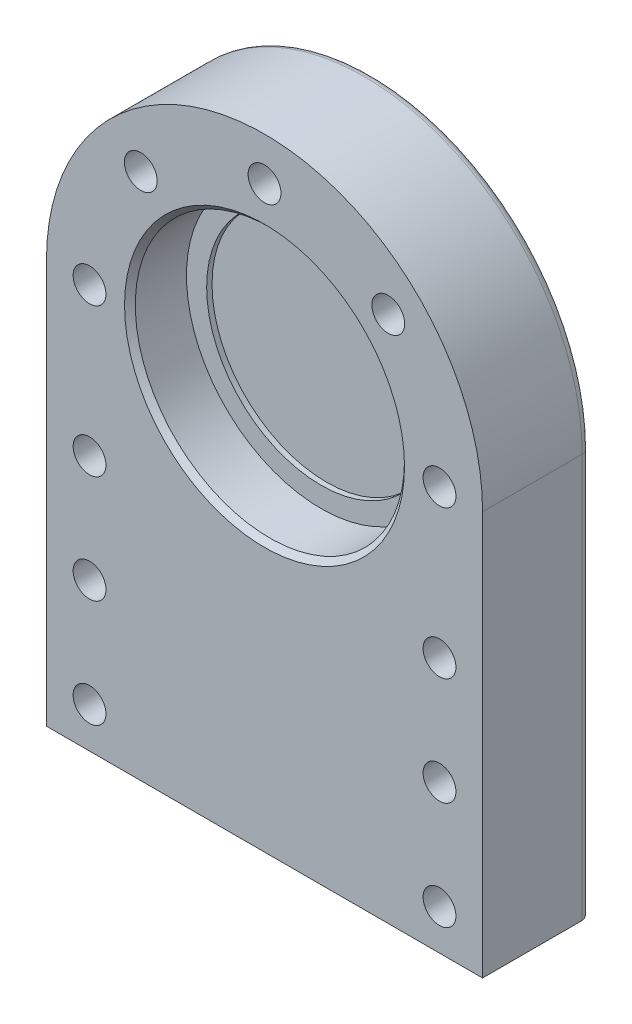
ISO-10303-21;
HEADER;
FILE_DESCRIPTION(('STEP AP214'),'2;1');
FILE_NAME('part.step','',(''),(''),'','','');
FILE_SCHEMA(('AUTOMOTIVE_DESIGN { 1 0 10303 214 1 1 1 1 }'));
ENDSEC;
DATA;
#1=APPLICATION_CONTEXT('core data for automotive mechanical design processes');
#2=APPLICATION_PROTOCOL_DEFINITION('international standard','automotive_design',2000,#1);
#3=PRODUCT_CONTEXT('',#1,'mechanical');
#4=PRODUCT('Part','Part','',(#3));
#5=PRODUCT_RELATED_PRODUCT_CATEGORY('part','',(#4));
#6=PRODUCT_DEFINITION_FORMATION('','',#4);
#7=PRODUCT_DEFINITION_CONTEXT('part definition',#1,'design');
#8=PRODUCT_DEFINITION('design','',#6,#7);
#9=PRODUCT_DEFINITION_SHAPE('','',#8);
#10=(LENGTH_UNIT() NAMED_UNIT(*) SI_UNIT(.MILLI.,.METRE.));
#11=(NAMED_UNIT(*) PLANE_ANGLE_UNIT() SI_UNIT($,.RADIAN.));
#12=(NAMED_UNIT(*) SI_UNIT($,.STERADIAN.) SOLID_ANGLE_UNIT());
#13=UNCERTAINTY_MEASURE_WITH_UNIT(LENGTH_MEASURE(1.E-05),#10,'distance_accuracy_value','');
#14=(GEOMETRIC_REPRESENTATION_CONTEXT(3) GLOBAL_UNCERTAINTY_ASSIGNED_CONTEXT((#13)) GLOBAL_UNIT_ASSIGNED_CONTEXT((#10,
#11,#12)) REPRESENTATION_CONTEXT('',''));
#15=CARTESIAN_POINT('',(0.,0.,0.));
#16=DIRECTION('',(0.,0.,1.));
#17=DIRECTION('',(1.,0.,0.));
#18=AXIS2_PLACEMENT_3D('',#15,#16,#17);
#19=CARTESIAN_POINT('',(0.,0.,40.));
#20=DIRECTION('',(0.,0.,-1.));
#21=DIRECTION('',(-1.,0.,0.));
#22=AXIS2_PLACEMENT_3D('',#19,#20,#21);
#23=CYLINDRICAL_SURFACE('',#22,81.);
#24=DIRECTION('',(0.,0.,-1.));
#25=VECTOR('',#24,1.);
#26=CARTESIAN_POINT('',(81.,0.,40.));
#27=LINE('',#26,#25);
#28=CARTESIAN_POINT('',(81.,0.,40.));
#29=VERTEX_POINT('',#28);
#30=CARTESIAN_POINT('',(81.,0.,3.));
#31=VERTEX_POINT('',#30);
#32=EDGE_CURVE('E278',#29,#31,#27,.T.);
#33=ORIENTED_EDGE('',*,*,#32,.T.);
#34=CARTESIAN_POINT('',(0.,0.,3.));
#35=DIRECTION('',(0.,0.,1.));
#36=DIRECTION('',(1.,0.,0.));
#37=AXIS2_PLACEMENT_3D('',#34,#35,#36);
#38=CIRCLE('',#37,81.);
#39=CARTESIAN_POINT('',(-81.,0.,3.));
#40=VERTEX_POINT('',#39);
#41=EDGE_CURVE('E120',#31,#40,#38,.T.);
#42=ORIENTED_EDGE('',*,*,#41,.T.);
#43=DIRECTION('',(0.,0.,-1.));
#44=VECTOR('',#43,1.);
#45=CARTESIAN_POINT('',(-81.,0.,40.));
#46=LINE('',#45,#44);
#47=CARTESIAN_POINT('',(-81.,0.,40.));
#48=VERTEX_POINT('',#47);
#49=EDGE_CURVE('E102',#48,#40,#46,.T.);
#50=ORIENTED_EDGE('',*,*,#49,.F.);
#51=CARTESIAN_POINT('',(0.,0.,40.));
#52=DIRECTION('',(0.,0.,1.));
#53=DIRECTION('',(1.,0.,0.));
#54=AXIS2_PLACEMENT_3D('',#51,#52,#53);
#55=CIRCLE('',#54,81.);
#56=EDGE_CURVE('E109',#29,#48,#55,.T.);
#57=ORIENTED_EDGE('',*,*,#56,.F.);
#58=EDGE_LOOP('',(#33,#42,#50,#57));
#59=FACE_BOUND('',#58,.T.);
#60=ADVANCED_FACE('F41',(#59),#23,.T.);
#61=CARTESIAN_POINT('',(-81.,0.,40.));
#62=DIRECTION('',(1.,0.,0.));
#63=DIRECTION('',(0.,0.,-1.));
#64=AXIS2_PLACEMENT_3D('',#61,#62,#63);
#65=PLANE('',#64);
#66=ORIENTED_EDGE('',*,*,#49,.T.);
#67=DIRECTION('',(0.,-1.,0.));
#68=VECTOR('',#67,1.);
#69=CARTESIAN_POINT('',(-81.,0.,3.));
#70=LINE('',#69,#68);
#71=CARTESIAN_POINT('',(-81.,-150.,3.));
#72=VERTEX_POINT('',#71);
#73=EDGE_CURVE('E136',#40,#72,#70,.T.);
#74=ORIENTED_EDGE('',*,*,#73,.T.);
#75=DIRECTION('',(0.,0.,-1.));
#76=VECTOR('',#75,1.);
#77=CARTESIAN_POINT('',(-81.,-150.,40.));
#78=LINE('',#77,#76);
#79=CARTESIAN_POINT('',(-81.,-150.,40.));
#80=VERTEX_POINT('',#79);
#81=EDGE_CURVE('E104',#80,#72,#78,.T.);
#82=ORIENTED_EDGE('',*,*,#81,.F.);
#83=DIRECTION('',(0.,-1.,0.));
#84=VECTOR('',#83,1.);
#85=CARTESIAN_POINT('',(-81.,0.,40.));
#86=LINE('',#85,#84);
#87=EDGE_CURVE('E97',#48,#80,#86,.T.);
#88=ORIENTED_EDGE('',*,*,#87,.F.);
#89=EDGE_LOOP('',(#66,#74,#82,#88));
#90=FACE_BOUND('',#89,.T.);
#91=ADVANCED_FACE('F99',(#90),#65,.F.);
#92=CARTESIAN_POINT('',(-81.,-150.,40.));
#93=DIRECTION('',(0.,1.,0.));
#94=DIRECTION('',(0.,0.,1.));
#95=AXIS2_PLACEMENT_3D('',#92,#93,#94);
#96=PLANE('',#95);
#97=ORIENTED_EDGE('',*,*,#81,.T.);
#98=DIRECTION('',(1.,0.,0.));
#99=VECTOR('',#98,1.);
#100=CARTESIAN_POINT('',(-81.,-150.,3.));
#101=LINE('',#100,#99);
#102=CARTESIAN_POINT('',(81.,-150.,3.));
#103=VERTEX_POINT('',#102);
#104=EDGE_CURVE('E11',#72,#103,#101,.T.);
#105=ORIENTED_EDGE('',*,*,#104,.T.);
#106=DIRECTION('',(0.,0.,-1.));
#107=VECTOR('',#106,1.);
#108=CARTESIAN_POINT('',(81.,-150.,40.));
#109=LINE('',#108,#107);
#110=CARTESIAN_POINT('',(81.,-150.,40.));
#111=VERTEX_POINT('',#110);
#112=EDGE_CURVE('E129',#111,#103,#109,.T.);
#113=ORIENTED_EDGE('',*,*,#112,.F.);
#114=DIRECTION('',(1.,0.,0.));
#115=VECTOR('',#114,1.);
#116=CARTESIAN_POINT('',(-81.,-150.,40.));
#117=LINE('',#116,#115);
#118=EDGE_CURVE('E108',#80,#111,#117,.T.);
#119=ORIENTED_EDGE('',*,*,#118,.F.);
#120=EDGE_LOOP('',(#97,#105,#113,#119));
#121=FACE_BOUND('',#120,.T.);
#122=ADVANCED_FACE('F290',(#121),#96,.F.);
#123=CARTESIAN_POINT('',(81.,-150.,40.));
#124=DIRECTION('',(-1.,0.,0.));
#125=DIRECTION('',(0.,0.,1.));
#126=AXIS2_PLACEMENT_3D('',#123,#124,#125);
#127=PLANE('',#126);
#128=ORIENTED_EDGE('',*,*,#112,.T.);
#129=DIRECTION('',(0.,1.,0.));
#130=VECTOR('',#129,1.);
#131=CARTESIAN_POINT('',(81.,-150.,3.));
#132=LINE('',#131,#130);
#133=EDGE_CURVE('E51',#103,#31,#132,.T.);
#134=ORIENTED_EDGE('',*,*,#133,.T.);
#135=ORIENTED_EDGE('',*,*,#32,.F.);
#136=DIRECTION('',(0.,1.,0.));
#137=VECTOR('',#136,1.);
#138=CARTESIAN_POINT('',(81.,-150.,40.));
#139=LINE('',#138,#137);
#140=EDGE_CURVE('E114',#111,#29,#139,.T.);
#141=ORIENTED_EDGE('',*,*,#140,.F.);
#142=EDGE_LOOP('',(#128,#134,#135,#141));
#143=FACE_BOUND('',#142,.T.);
#144=ADVANCED_FACE('F281',(#143),#127,.F.);
#145=CARTESIAN_POINT('',(0.,0.,40.));
#146=DIRECTION('',(0.,0.,1.));
#147=DIRECTION('',(1.,0.,0.));
#148=AXIS2_PLACEMENT_3D('',#145,#146,#147);
#149=PLANE('',#148);
#150=CARTESIAN_POINT('',(0.,0.,40.));
#151=DIRECTION('',(0.,0.,1.));
#152=DIRECTION('',(1.,0.,0.));
#153=AXIS2_PLACEMENT_3D('',#150,#151,#152);
#154=CIRCLE('',#153,52.0000000000001);
#155=CARTESIAN_POINT('',(52.0000000000001,0.,40.));
#156=VERTEX_POINT('',#155);
#157=EDGE_CURVE('E127',#156,#156,#154,.F.);
#158=ORIENTED_EDGE('',*,*,#157,.T.);
#159=EDGE_LOOP('',(#158));
#160=FACE_BOUND('',#159,.T.);
#161=CARTESIAN_POINT('',(65.,-135.,40.));
#162=DIRECTION('',(0.,0.,-1.));
#163=DIRECTION('',(-1.,0.,0.));
#164=AXIS2_PLACEMENT_3D('',#161,#162,#163);
#165=CIRCLE('',#164,6.1);
#166=CARTESIAN_POINT('',(58.9,-135.,40.));
#167=VERTEX_POINT('',#166);
#168=EDGE_CURVE('E193',#167,#167,#165,.T.);
#169=ORIENTED_EDGE('',*,*,#168,.T.);
#170=EDGE_LOOP('',(#169));
#171=FACE_BOUND('',#170,.T.);
#172=CARTESIAN_POINT('',(65.,-95.,40.));
#173=DIRECTION('',(0.,0.,-1.));
#174=DIRECTION('',(-1.,0.,0.));
#175=AXIS2_PLACEMENT_3D('',#172,#173,#174);
#176=CIRCLE('',#175,6.1);
#177=CARTESIAN_POINT('',(58.9,-95.,40.));
#178=VERTEX_POINT('',#177);
#179=EDGE_CURVE('E201',#178,#178,#176,.T.);
#180=ORIENTED_EDGE('',*,*,#179,.T.);
#181=EDGE_LOOP('',(#180));
#182=FACE_BOUND('',#181,.T.);
#183=CARTESIAN_POINT('',(65.,-55.,40.));
#184=DIRECTION('',(0.,0.,-1.));
#185=DIRECTION('',(-1.,0.,0.));
#186=AXIS2_PLACEMENT_3D('',#183,#184,#185);
#187=CIRCLE('',#186,6.1);
#188=CARTESIAN_POINT('',(58.9,-55.,40.));
#189=VERTEX_POINT('',#188);
#190=EDGE_CURVE('E187',#189,#189,#187,.T.);
#191=ORIENTED_EDGE('',*,*,#190,.T.);
#192=EDGE_LOOP('',(#191));
#193=FACE_BOUND('',#192,.T.);
#194=CARTESIAN_POINT('',(-65.,-135.,40.));
#195=DIRECTION('',(0.,0.,1.));
#196=DIRECTION('',(1.,0.,0.));
#197=AXIS2_PLACEMENT_3D('',#194,#195,#196);
#198=CIRCLE('',#197,6.1);
#199=CARTESIAN_POINT('',(-58.9,-135.,40.));
#200=VERTEX_POINT('',#199);
#201=EDGE_CURVE('E217',#200,#200,#198,.T.);
#202=ORIENTED_EDGE('',*,*,#201,.F.);
#203=EDGE_LOOP('',(#202));
#204=FACE_BOUND('',#203,.T.);
#205=CARTESIAN_POINT('',(-65.,-95.,40.));
#206=DIRECTION('',(0.,0.,1.));
#207=DIRECTION('',(1.,0.,0.));
#208=AXIS2_PLACEMENT_3D('',#205,#206,#207);
#209=CIRCLE('',#208,6.1);
#210=CARTESIAN_POINT('',(-58.9,-95.,40.));
#211=VERTEX_POINT('',#210);
#212=EDGE_CURVE('E225',#211,#211,#209,.T.);
#213=ORIENTED_EDGE('',*,*,#212,.F.);
#214=EDGE_LOOP('',(#213));
#215=FACE_BOUND('',#214,.T.);
#216=CARTESIAN_POINT('',(-65.,-55.,40.));
#217=DIRECTION('',(0.,0.,1.));
#218=DIRECTION('',(1.,0.,0.));
#219=AXIS2_PLACEMENT_3D('',#216,#217,#218);
#220=CIRCLE('',#219,6.1);
#221=CARTESIAN_POINT('',(-58.9,-55.,40.));
#222=VERTEX_POINT('',#221);
#223=EDGE_CURVE('E192',#222,#222,#220,.T.);
#224=ORIENTED_EDGE('',*,*,#223,.F.);
#225=EDGE_LOOP('',(#224));
#226=FACE_BOUND('',#225,.T.);
#227=CARTESIAN_POINT('',(-45.9619407771255,45.9619407771257,40.));
#228=DIRECTION('',(0.,0.,1.));
#229=DIRECTION('',(0.707106781186546,-0.707106781186549,0.));
#230=AXIS2_PLACEMENT_3D('',#227,#228,#229);
#231=CIRCLE('',#230,6.1);
#232=CARTESIAN_POINT('',(-41.6485894118876,41.6485894118877,40.));
#233=VERTEX_POINT('',#232);
#234=EDGE_CURVE('E241',#233,#233,#231,.T.);
#235=ORIENTED_EDGE('',*,*,#234,.F.);
#236=EDGE_LOOP('',(#235));
#237=FACE_BOUND('',#236,.T.);
#238=CARTESIAN_POINT('',(2.26946287024804E-13,65.,40.));
#239=DIRECTION('',(0.,0.,1.));
#240=DIRECTION('',(0.,-1.,0.));
#241=AXIS2_PLACEMENT_3D('',#238,#239,#240);
#242=CIRCLE('',#241,6.1);
#243=CARTESIAN_POINT('',(2.05648250857861E-13,58.9,40.));
#244=VERTEX_POINT('',#243);
#245=EDGE_CURVE('E249',#244,#244,#242,.T.);
#246=ORIENTED_EDGE('',*,*,#245,.F.);
#247=EDGE_LOOP('',(#246));
#248=FACE_BOUND('',#247,.T.);
#249=CARTESIAN_POINT('',(45.9619407771258,45.9619407771253,40.));
#250=DIRECTION('',(0.,0.,1.));
#251=DIRECTION('',(-0.707106781186551,-0.707106781186544,0.));
#252=AXIS2_PLACEMENT_3D('',#249,#250,#251);
#253=CIRCLE('',#252,6.1);
#254=CARTESIAN_POINT('',(41.6485894118879,41.6485894118874,40.));
#255=VERTEX_POINT('',#254);
#256=EDGE_CURVE('E257',#255,#255,#253,.T.);
#257=ORIENTED_EDGE('',*,*,#256,.F.);
#258=EDGE_LOOP('',(#257));
#259=FACE_BOUND('',#258,.T.);
#260=CARTESIAN_POINT('',(65.,0.,40.));
#261=DIRECTION('',(0.,0.,1.));
#262=DIRECTION('',(-1.,0.,0.));
#263=AXIS2_PLACEMENT_3D('',#260,#261,#262);
#264=CIRCLE('',#263,6.1);
#265=CARTESIAN_POINT('',(58.9,0.,40.));
#266=VERTEX_POINT('',#265);
#267=EDGE_CURVE('E216',#266,#266,#264,.T.);
#268=ORIENTED_EDGE('',*,*,#267,.F.);
#269=EDGE_LOOP('',(#268));
#270=FACE_BOUND('',#269,.T.);
#271=CARTESIAN_POINT('',(-65.,0.,40.));
#272=DIRECTION('',(0.,0.,1.));
#273=DIRECTION('',(1.,0.,0.));
#274=AXIS2_PLACEMENT_3D('',#271,#272,#273);
#275=CIRCLE('',#274,6.1);
#276=CARTESIAN_POINT('',(-58.9,0.,40.));
#277=VERTEX_POINT('',#276);
#278=EDGE_CURVE('E240',#277,#277,#275,.T.);
#279=ORIENTED_EDGE('',*,*,#278,.F.);
#280=EDGE_LOOP('',(#279));
#281=FACE_BOUND('',#280,.T.);
#282=ORIENTED_EDGE('',*,*,#56,.T.);
#283=ORIENTED_EDGE('',*,*,#87,.T.);
#284=ORIENTED_EDGE('',*,*,#118,.T.);
#285=ORIENTED_EDGE('',*,*,#140,.T.);
#286=EDGE_LOOP('',(#282,#283,#284,#285));
#287=FACE_BOUND('',#286,.T.);
#288=ADVANCED_FACE('F112',(#160,#171,#182,#193,#204,#215,#226,#237,#248,#259,#270,#281,#287),
#149,.T.);
#289=CARTESIAN_POINT('',(0.,0.,0.));
#290=DIRECTION('',(0.,0.,1.));
#291=DIRECTION('',(1.,0.,0.));
#292=AXIS2_PLACEMENT_3D('',#289,#290,#291);
#293=PLANE('',#292);
#294=DIRECTION('',(1.,0.,0.));
#295=VECTOR('',#294,1.);
#296=CARTESIAN_POINT('',(0.,-147.,0.));
#297=LINE('',#296,#295);
#298=CARTESIAN_POINT('',(78.,-147.,0.));
#299=VERTEX_POINT('',#298);
#300=CARTESIAN_POINT('',(-78.,-147.,0.));
#301=VERTEX_POINT('',#300);
#302=EDGE_CURVE('E139',#299,#301,#297,.F.);
#303=ORIENTED_EDGE('',*,*,#302,.T.);
#304=DIRECTION('',(0.,-1.,0.));
#305=VECTOR('',#304,1.);
#306=CARTESIAN_POINT('',(-78.,0.,0.));
#307=LINE('',#306,#305);
#308=CARTESIAN_POINT('',(-78.,0.,0.));
#309=VERTEX_POINT('',#308);
#310=EDGE_CURVE('E148',#301,#309,#307,.F.);
#311=ORIENTED_EDGE('',*,*,#310,.T.);
#312=CARTESIAN_POINT('',(0.,0.,0.));
#313=DIRECTION('',(0.,0.,1.));
#314=DIRECTION('',(1.,0.,0.));
#315=AXIS2_PLACEMENT_3D('',#312,#313,#314);
#316=CIRCLE('',#315,78.);
#317=CARTESIAN_POINT('',(78.,0.,0.));
#318=VERTEX_POINT('',#317);
#319=EDGE_CURVE('E145',#309,#318,#316,.F.);
#320=ORIENTED_EDGE('',*,*,#319,.T.);
#321=DIRECTION('',(0.,1.,0.));
#322=VECTOR('',#321,1.);
#323=CARTESIAN_POINT('',(78.,0.,0.));
#324=LINE('',#323,#322);
#325=EDGE_CURVE('E142',#318,#299,#324,.F.);
#326=ORIENTED_EDGE('',*,*,#325,.T.);
#327=EDGE_LOOP('',(#303,#311,#320,#326));
#328=FACE_BOUND('',#327,.T.);
#329=CARTESIAN_POINT('',(65.,-135.,0.));
#330=DIRECTION('',(0.,0.,-1.));
#331=DIRECTION('',(-1.,0.,0.));
#332=AXIS2_PLACEMENT_3D('',#329,#330,#331);
#333=CIRCLE('',#332,6.1);
#334=CARTESIAN_POINT('',(58.9,-135.,0.));
#335=VERTEX_POINT('',#334);
#336=EDGE_CURVE('E188',#335,#335,#333,.T.);
#337=ORIENTED_EDGE('',*,*,#336,.F.);
#338=EDGE_LOOP('',(#337));
#339=FACE_BOUND('',#338,.T.);
#340=CARTESIAN_POINT('',(65.,-95.,0.));
#341=DIRECTION('',(0.,0.,-1.));
#342=DIRECTION('',(-1.,0.,0.));
#343=AXIS2_PLACEMENT_3D('',#340,#341,#342);
#344=CIRCLE('',#343,6.1);
#345=CARTESIAN_POINT('',(58.9,-95.,0.));
#346=VERTEX_POINT('',#345);
#347=EDGE_CURVE('E197',#346,#346,#344,.T.);
#348=ORIENTED_EDGE('',*,*,#347,.F.);
#349=EDGE_LOOP('',(#348));
#350=FACE_BOUND('',#349,.T.);
#351=CARTESIAN_POINT('',(65.,-55.,0.));
#352=DIRECTION('',(0.,0.,-1.));
#353=DIRECTION('',(-1.,0.,0.));
#354=AXIS2_PLACEMENT_3D('',#351,#352,#353);
#355=CIRCLE('',#354,6.1);
#356=CARTESIAN_POINT('',(58.9,-55.,0.));
#357=VERTEX_POINT('',#356);
#358=EDGE_CURVE('E205',#357,#357,#355,.T.);
#359=ORIENTED_EDGE('',*,*,#358,.F.);
#360=EDGE_LOOP('',(#359));
#361=FACE_BOUND('',#360,.T.);
#362=CARTESIAN_POINT('',(-65.,-135.,0.));
#363=DIRECTION('',(0.,0.,1.));
#364=DIRECTION('',(1.,0.,0.));
#365=AXIS2_PLACEMENT_3D('',#362,#363,#364);
#366=CIRCLE('',#365,6.1);
#367=CARTESIAN_POINT('',(-58.9,-135.,0.));
#368=VERTEX_POINT('',#367);
#369=EDGE_CURVE('E212',#368,#368,#366,.T.);
#370=ORIENTED_EDGE('',*,*,#369,.T.);
#371=EDGE_LOOP('',(#370));
#372=FACE_BOUND('',#371,.T.);
#373=CARTESIAN_POINT('',(-65.,-95.,0.));
#374=DIRECTION('',(0.,0.,1.));
#375=DIRECTION('',(1.,0.,0.));
#376=AXIS2_PLACEMENT_3D('',#373,#374,#375);
#377=CIRCLE('',#376,6.1);
#378=CARTESIAN_POINT('',(-58.9,-95.,0.));
#379=VERTEX_POINT('',#378);
#380=EDGE_CURVE('E221',#379,#379,#377,.T.);
#381=ORIENTED_EDGE('',*,*,#380,.T.);
#382=EDGE_LOOP('',(#381));
#383=FACE_BOUND('',#382,.T.);
#384=CARTESIAN_POINT('',(-65.,-55.,0.));
#385=DIRECTION('',(0.,0.,1.));
#386=DIRECTION('',(1.,0.,0.));
#387=AXIS2_PLACEMENT_3D('',#384,#385,#386);
#388=CIRCLE('',#387,6.1);
#389=CARTESIAN_POINT('',(-58.9,-55.,0.));
#390=VERTEX_POINT('',#389);
#391=EDGE_CURVE('E229',#390,#390,#388,.T.);
#392=ORIENTED_EDGE('',*,*,#391,.T.);
#393=EDGE_LOOP('',(#392));
#394=FACE_BOUND('',#393,.T.);
#395=CARTESIAN_POINT('',(-45.9619407771255,45.9619407771257,0.));
#396=DIRECTION('',(0.,0.,1.));
#397=DIRECTION('',(0.707106781186546,-0.707106781186549,0.));
#398=AXIS2_PLACEMENT_3D('',#395,#396,#397);
#399=CIRCLE('',#398,6.1);
#400=CARTESIAN_POINT('',(-41.6485894118876,41.6485894118877,0.));
#401=VERTEX_POINT('',#400);
#402=EDGE_CURVE('E236',#401,#401,#399,.T.);
#403=ORIENTED_EDGE('',*,*,#402,.T.);
#404=EDGE_LOOP('',(#403));
#405=FACE_BOUND('',#404,.T.);
#406=CARTESIAN_POINT('',(2.26946287024804E-13,65.,0.));
#407=DIRECTION('',(0.,0.,1.));
#408=DIRECTION('',(0.,-1.,0.));
#409=AXIS2_PLACEMENT_3D('',#406,#407,#408);
#410=CIRCLE('',#409,6.1);
#411=CARTESIAN_POINT('',(2.05648250857861E-13,58.9,0.));
#412=VERTEX_POINT('',#411);
#413=EDGE_CURVE('E245',#412,#412,#410,.T.);
#414=ORIENTED_EDGE('',*,*,#413,.T.);
#415=EDGE_LOOP('',(#414));
#416=FACE_BOUND('',#415,.T.);
#417=CARTESIAN_POINT('',(45.9619407771258,45.9619407771253,0.));
#418=DIRECTION('',(0.,0.,1.));
#419=DIRECTION('',(-0.707106781186551,-0.707106781186544,0.));
#420=AXIS2_PLACEMENT_3D('',#417,#418,#419);
#421=CIRCLE('',#420,6.1);
#422=CARTESIAN_POINT('',(41.6485894118879,41.6485894118874,0.));
#423=VERTEX_POINT('',#422);
#424=EDGE_CURVE('E253',#423,#423,#421,.T.);
#425=ORIENTED_EDGE('',*,*,#424,.T.);
#426=EDGE_LOOP('',(#425));
#427=FACE_BOUND('',#426,.T.);
#428=CARTESIAN_POINT('',(65.,0.,0.));
#429=DIRECTION('',(0.,0.,1.));
#430=DIRECTION('',(-1.,0.,0.));
#431=AXIS2_PLACEMENT_3D('',#428,#429,#430);
#432=CIRCLE('',#431,6.1);
#433=CARTESIAN_POINT('',(58.9,0.,0.));
#434=VERTEX_POINT('',#433);
#435=EDGE_CURVE('E261',#434,#434,#432,.T.);
#436=ORIENTED_EDGE('',*,*,#435,.T.);
#437=EDGE_LOOP('',(#436));
#438=FACE_BOUND('',#437,.T.);
#439=CARTESIAN_POINT('',(-65.,0.,0.));
#440=DIRECTION('',(0.,0.,1.));
#441=DIRECTION('',(1.,0.,0.));
#442=AXIS2_PLACEMENT_3D('',#439,#440,#441);
#443=CIRCLE('',#442,6.1);
#444=CARTESIAN_POINT('',(-58.9,0.,0.));
#445=VERTEX_POINT('',#444);
#446=EDGE_CURVE('E117',#445,#445,#443,.T.);
#447=ORIENTED_EDGE('',*,*,#446,.T.);
#448=EDGE_LOOP('',(#447));
#449=FACE_BOUND('',#448,.T.);
#450=ADVANCED_FACE('F446',(#328,#339,#350,#361,#372,#383,#394,#405,#416,#427,#438,#449),#293,.F.);
#451=CARTESIAN_POINT('',(-65.,0.,0.));
#452=DIRECTION('',(0.,0.,1.));
#453=DIRECTION('',(1.,0.,0.));
#454=AXIS2_PLACEMENT_3D('',#451,#452,#453);
#455=CYLINDRICAL_SURFACE('',#454,6.1);
#456=ORIENTED_EDGE('',*,*,#446,.F.);
#457=EDGE_LOOP('',(#456));
#458=FACE_BOUND('',#457,.T.);
#459=ORIENTED_EDGE('',*,*,#278,.T.);
#460=EDGE_LOOP('',(#459));
#461=FACE_BOUND('',#460,.T.);
#462=ADVANCED_FACE('F438',(#458,#461),#455,.F.);
#463=CARTESIAN_POINT('',(65.,0.,0.));
#464=DIRECTION('',(0.,0.,1.));
#465=DIRECTION('',(1.,0.,0.));
#466=AXIS2_PLACEMENT_3D('',#463,#464,#465);
#467=CYLINDRICAL_SURFACE('',#466,6.1);
#468=ORIENTED_EDGE('',*,*,#435,.F.);
#469=EDGE_LOOP('',(#468));
#470=FACE_BOUND('',#469,.T.);
#471=ORIENTED_EDGE('',*,*,#267,.T.);
#472=EDGE_LOOP('',(#471));
#473=FACE_BOUND('',#472,.T.);
#474=ADVANCED_FACE('F430',(#470,#473),#467,.F.);
#475=CARTESIAN_POINT('',(45.9619407771258,45.9619407771253,0.));
#476=DIRECTION('',(0.,0.,1.));
#477=DIRECTION('',(1.,0.,0.));
#478=AXIS2_PLACEMENT_3D('',#475,#476,#477);
#479=CYLINDRICAL_SURFACE('',#478,6.1);
#480=ORIENTED_EDGE('',*,*,#424,.F.);
#481=EDGE_LOOP('',(#480));
#482=FACE_BOUND('',#481,.T.);
#483=ORIENTED_EDGE('',*,*,#256,.T.);
#484=EDGE_LOOP('',(#483));
#485=FACE_BOUND('',#484,.T.);
#486=ADVANCED_FACE('F422',(#482,#485),#479,.F.);
#487=CARTESIAN_POINT('',(2.26946287024804E-13,65.,0.));
#488=DIRECTION('',(0.,0.,1.));
#489=DIRECTION('',(1.,0.,0.));
#490=AXIS2_PLACEMENT_3D('',#487,#488,#489);
#491=CYLINDRICAL_SURFACE('',#490,6.1);
#492=ORIENTED_EDGE('',*,*,#413,.F.);
#493=EDGE_LOOP('',(#492));
#494=FACE_BOUND('',#493,.T.);
#495=ORIENTED_EDGE('',*,*,#245,.T.);
#496=EDGE_LOOP('',(#495));
#497=FACE_BOUND('',#496,.T.);
#498=ADVANCED_FACE('F414',(#494,#497),#491,.F.);
#499=CARTESIAN_POINT('',(-45.9619407771255,45.9619407771257,0.));
#500=DIRECTION('',(0.,0.,1.));
#501=DIRECTION('',(1.,0.,0.));
#502=AXIS2_PLACEMENT_3D('',#499,#500,#501);
#503=CYLINDRICAL_SURFACE('',#502,6.1);
#504=ORIENTED_EDGE('',*,*,#402,.F.);
#505=EDGE_LOOP('',(#504));
#506=FACE_BOUND('',#505,.T.);
#507=ORIENTED_EDGE('',*,*,#234,.T.);
#508=EDGE_LOOP('',(#507));
#509=FACE_BOUND('',#508,.T.);
#510=ADVANCED_FACE('F406',(#506,#509),#503,.F.);
#511=CARTESIAN_POINT('',(-65.,-55.,0.));
#512=DIRECTION('',(0.,0.,1.));
#513=DIRECTION('',(1.,0.,0.));
#514=AXIS2_PLACEMENT_3D('',#511,#512,#513);
#515=CYLINDRICAL_SURFACE('',#514,6.1);
#516=ORIENTED_EDGE('',*,*,#391,.F.);
#517=EDGE_LOOP('',(#516));
#518=FACE_BOUND('',#517,.T.);
#519=ORIENTED_EDGE('',*,*,#223,.T.);
#520=EDGE_LOOP('',(#519));
#521=FACE_BOUND('',#520,.T.);
#522=ADVANCED_FACE('F398',(#518,#521),#515,.F.);
#523=CARTESIAN_POINT('',(-65.,-95.,0.));
#524=DIRECTION('',(0.,0.,1.));
#525=DIRECTION('',(1.,0.,0.));
#526=AXIS2_PLACEMENT_3D('',#523,#524,#525);
#527=CYLINDRICAL_SURFACE('',#526,6.1);
#528=ORIENTED_EDGE('',*,*,#380,.F.);
#529=EDGE_LOOP('',(#528));
#530=FACE_BOUND('',#529,.T.);
#531=ORIENTED_EDGE('',*,*,#212,.T.);
#532=EDGE_LOOP('',(#531));
#533=FACE_BOUND('',#532,.T.);
#534=ADVANCED_FACE('F390',(#530,#533),#527,.F.);
#535=CARTESIAN_POINT('',(-65.,-135.,0.));
#536=DIRECTION('',(0.,0.,1.));
#537=DIRECTION('',(1.,0.,0.));
#538=AXIS2_PLACEMENT_3D('',#535,#536,#537);
#539=CYLINDRICAL_SURFACE('',#538,6.1);
#540=ORIENTED_EDGE('',*,*,#369,.F.);
#541=EDGE_LOOP('',(#540));
#542=FACE_BOUND('',#541,.T.);
#543=ORIENTED_EDGE('',*,*,#201,.T.);
#544=EDGE_LOOP('',(#543));
#545=FACE_BOUND('',#544,.T.);
#546=ADVANCED_FACE('F382',(#542,#545),#539,.F.);
#547=CARTESIAN_POINT('',(65.,-55.,0.));
#548=DIRECTION('',(0.,0.,1.));
#549=DIRECTION('',(1.,0.,0.));
#550=AXIS2_PLACEMENT_3D('',#547,#548,#549);
#551=CYLINDRICAL_SURFACE('',#550,6.1);
#552=ORIENTED_EDGE('',*,*,#358,.T.);
#553=EDGE_LOOP('',(#552));
#554=FACE_BOUND('',#553,.T.);
#555=ORIENTED_EDGE('',*,*,#190,.F.);
#556=EDGE_LOOP('',(#555));
#557=FACE_BOUND('',#556,.T.);
#558=ADVANCED_FACE('F374',(#554,#557),#551,.F.);
#559=CARTESIAN_POINT('',(65.,-95.,0.));
#560=DIRECTION('',(0.,0.,1.));
#561=DIRECTION('',(1.,0.,0.));
#562=AXIS2_PLACEMENT_3D('',#559,#560,#561);
#563=CYLINDRICAL_SURFACE('',#562,6.1);
#564=ORIENTED_EDGE('',*,*,#347,.T.);
#565=EDGE_LOOP('',(#564));
#566=FACE_BOUND('',#565,.T.);
#567=ORIENTED_EDGE('',*,*,#179,.F.);
#568=EDGE_LOOP('',(#567));
#569=FACE_BOUND('',#568,.T.);
#570=ADVANCED_FACE('F366',(#566,#569),#563,.F.);
#571=CARTESIAN_POINT('',(65.,-135.,0.));
#572=DIRECTION('',(0.,0.,1.));
#573=DIRECTION('',(1.,0.,0.));
#574=AXIS2_PLACEMENT_3D('',#571,#572,#573);
#575=CYLINDRICAL_SURFACE('',#574,6.1);
#576=ORIENTED_EDGE('',*,*,#336,.T.);
#577=EDGE_LOOP('',(#576));
#578=FACE_BOUND('',#577,.T.);
#579=ORIENTED_EDGE('',*,*,#168,.F.);
#580=EDGE_LOOP('',(#579));
#581=FACE_BOUND('',#580,.T.);
#582=ADVANCED_FACE('F359',(#578,#581),#575,.F.);
#583=CARTESIAN_POINT('',(0.,0.,19.));
#584=DIRECTION('',(0.,0.,1.));
#585=DIRECTION('',(1.,0.,0.));
#586=AXIS2_PLACEMENT_3D('',#583,#584,#585);
#587=CYLINDRICAL_SURFACE('',#586,50.);
#588=CARTESIAN_POINT('',(0.,0.,37.9999999999999));
#589=DIRECTION('',(0.,0.,1.));
#590=DIRECTION('',(1.,0.,0.));
#591=AXIS2_PLACEMENT_3D('',#588,#589,#590);
#592=CIRCLE('',#591,50.);
#593=CARTESIAN_POINT('',(50.,0.,37.9999999999999));
#594=VERTEX_POINT('',#593);
#595=EDGE_CURVE('E122',#594,#594,#592,.T.);
#596=ORIENTED_EDGE('',*,*,#595,.T.);
#597=EDGE_LOOP('',(#596));
#598=FACE_BOUND('',#597,.T.);
#599=CARTESIAN_POINT('',(0.,0.,19.));
#600=DIRECTION('',(0.,0.,1.));
#601=DIRECTION('',(1.,0.,0.));
#602=AXIS2_PLACEMENT_3D('',#599,#600,#601);
#603=CIRCLE('',#602,50.);
#604=CARTESIAN_POINT('',(50.,0.,19.));
#605=VERTEX_POINT('',#604);
#606=EDGE_CURVE('E181',#605,#605,#603,.T.);
#607=ORIENTED_EDGE('',*,*,#606,.F.);
#608=EDGE_LOOP('',(#607));
#609=FACE_BOUND('',#608,.T.);
#610=ADVANCED_FACE('F351',(#598,#609),#587,.F.);
#611=CARTESIAN_POINT('',(0.,0.,19.));
#612=DIRECTION('',(0.,0.,1.));
#613=DIRECTION('',(1.,0.,0.));
#614=AXIS2_PLACEMENT_3D('',#611,#612,#613);
#615=PLANE('',#614);
#616=CARTESIAN_POINT('',(0.,0.,19.));
#617=DIRECTION('',(0.,0.,1.));
#618=DIRECTION('',(1.,0.,0.));
#619=AXIS2_PLACEMENT_3D('',#616,#617,#618);
#620=CIRCLE('',#619,42.5);
#621=CARTESIAN_POINT('',(42.5,0.,19.));
#622=VERTEX_POINT('',#621);
#623=EDGE_CURVE('E169',#622,#622,#620,.T.);
#624=ORIENTED_EDGE('',*,*,#623,.F.);
#625=EDGE_LOOP('',(#624));
#626=FACE_BOUND('',#625,.T.);
#627=ORIENTED_EDGE('',*,*,#606,.T.);
#628=EDGE_LOOP('',(#627));
#629=FACE_BOUND('',#628,.T.);
#630=ADVANCED_FACE('F343',(#626,#629),#615,.T.);
#631=CARTESIAN_POINT('',(0.,0.,17.));
#632=DIRECTION('',(0.,0.,1.));
#633=DIRECTION('',(1.,0.,0.));
#634=AXIS2_PLACEMENT_3D('',#631,#632,#633);
#635=CYLINDRICAL_SURFACE('',#634,42.5);
#636=CARTESIAN_POINT('',(0.,0.,17.));
#637=DIRECTION('',(0.,0.,1.));
#638=DIRECTION('',(1.,0.,0.));
#639=AXIS2_PLACEMENT_3D('',#636,#637,#638);
#640=CIRCLE('',#639,42.5);
#641=CARTESIAN_POINT('',(42.5,0.,17.));
#642=VERTEX_POINT('',#641);
#643=EDGE_CURVE('E175',#642,#642,#640,.T.);
#644=ORIENTED_EDGE('',*,*,#643,.F.);
#645=EDGE_LOOP('',(#644));
#646=FACE_BOUND('',#645,.T.);
#647=ORIENTED_EDGE('',*,*,#623,.T.);
#648=EDGE_LOOP('',(#647));
#649=FACE_BOUND('',#648,.T.);
#650=ADVANCED_FACE('F334',(#646,#649),#635,.F.);
#651=CARTESIAN_POINT('',(0.,0.,17.));
#652=DIRECTION('',(0.,0.,1.));
#653=DIRECTION('',(1.,0.,0.));
#654=AXIS2_PLACEMENT_3D('',#651,#652,#653);
#655=PLANE('',#654);
#656=ORIENTED_EDGE('',*,*,#643,.T.);
#657=EDGE_LOOP('',(#656));
#658=FACE_BOUND('',#657,.T.);
#659=ADVANCED_FACE('F310',(#658),#655,.T.);
#660=CARTESIAN_POINT('',(0.,0.,37.9999999999999));
#661=DIRECTION('',(0.,0.,1.));
#662=DIRECTION('',(1.,0.,0.));
#663=AXIS2_PLACEMENT_3D('',#660,#661,#662);
#664=CONICAL_SURFACE('',#663,50.,0.785398163397448);
#665=ORIENTED_EDGE('',*,*,#157,.F.);
#666=EDGE_LOOP('',(#665));
#667=FACE_BOUND('',#666,.T.);
#668=ORIENTED_EDGE('',*,*,#595,.F.);
#669=EDGE_LOOP('',(#668));
#670=FACE_BOUND('',#669,.T.);
#671=ADVANCED_FACE('F305',(#667,#670),#664,.F.);
#672=CARTESIAN_POINT('',(78.,-150.,3.));
#673=DIRECTION('',(0.,1.,0.));
#674=DIRECTION('',(0.,0.,1.));
#675=AXIS2_PLACEMENT_3D('',#672,#673,#674);
#676=CYLINDRICAL_SURFACE('',#675,3.);
#677=CARTESIAN_POINT('',(78.,-147.,3.));
#678=DIRECTION('',(0.707106781186547,0.707106781186547,0.));
#679=DIRECTION('',(0.707106781186547,-0.707106781186547,0.));
#680=AXIS2_PLACEMENT_3D('',#677,#678,#679);
#681=ELLIPSE('',#680,4.24264068711928,3.);
#682=EDGE_CURVE('E161',#299,#103,#681,.F.);
#683=ORIENTED_EDGE('',*,*,#682,.F.);
#684=ORIENTED_EDGE('',*,*,#325,.F.);
#685=CARTESIAN_POINT('',(78.,0.,3.));
#686=DIRECTION('',(0.,1.,0.));
#687=DIRECTION('',(0.,0.,1.));
#688=AXIS2_PLACEMENT_3D('',#685,#686,#687);
#689=CIRCLE('',#688,3.);
#690=EDGE_CURVE('E45',#31,#318,#689,.T.);
#691=ORIENTED_EDGE('',*,*,#690,.F.);
#692=ORIENTED_EDGE('',*,*,#133,.F.);
#693=EDGE_LOOP('',(#683,#684,#691,#692));
#694=FACE_BOUND('',#693,.T.);
#695=ADVANCED_FACE('F43',(#694),#676,.T.);
#696=CARTESIAN_POINT('',(0.,0.,3.));
#697=DIRECTION('',(0.,0.,1.));
#698=DIRECTION('',(1.,0.,0.));
#699=AXIS2_PLACEMENT_3D('',#696,#697,#698);
#700=TOROIDAL_SURFACE('',#699,78.,3.);
#701=ORIENTED_EDGE('',*,*,#690,.T.);
#702=ORIENTED_EDGE('',*,*,#319,.F.);
#703=CARTESIAN_POINT('',(-78.,0.,3.));
#704=DIRECTION('',(0.,-1.,0.));
#705=DIRECTION('',(0.,0.,-1.));
#706=AXIS2_PLACEMENT_3D('',#703,#704,#705);
#707=CIRCLE('',#706,3.);
#708=EDGE_CURVE('E159',#40,#309,#707,.T.);
#709=ORIENTED_EDGE('',*,*,#708,.F.);
#710=ORIENTED_EDGE('',*,*,#41,.F.);
#711=EDGE_LOOP('',(#701,#702,#709,#710));
#712=FACE_BOUND('',#711,.T.);
#713=ADVANCED_FACE('F284',(#712),#700,.T.);
#714=CARTESIAN_POINT('',(-81.,-147.,3.));
#715=DIRECTION('',(1.,0.,0.));
#716=DIRECTION('',(0.,0.,-1.));
#717=AXIS2_PLACEMENT_3D('',#714,#715,#716);
#718=CYLINDRICAL_SURFACE('',#717,3.);
#719=ORIENTED_EDGE('',*,*,#682,.T.);
#720=ORIENTED_EDGE('',*,*,#104,.F.);
#721=CARTESIAN_POINT('',(-78.,-147.,3.));
#722=DIRECTION('',(0.707106781186547,-0.707106781186547,0.));
#723=DIRECTION('',(0.707106781186547,0.707106781186547,0.));
#724=AXIS2_PLACEMENT_3D('',#721,#722,#723);
#725=ELLIPSE('',#724,4.24264068711928,3.);
#726=EDGE_CURVE('E156',#301,#72,#725,.F.);
#727=ORIENTED_EDGE('',*,*,#726,.F.);
#728=ORIENTED_EDGE('',*,*,#302,.F.);
#729=EDGE_LOOP('',(#719,#720,#727,#728));
#730=FACE_BOUND('',#729,.T.);
#731=ADVANCED_FACE('F314',(#730),#718,.T.);
#732=CARTESIAN_POINT('',(-78.,0.,3.));
#733=DIRECTION('',(0.,-1.,0.));
#734=DIRECTION('',(0.,0.,-1.));
#735=AXIS2_PLACEMENT_3D('',#732,#733,#734);
#736=CYLINDRICAL_SURFACE('',#735,3.);
#737=ORIENTED_EDGE('',*,*,#708,.T.);
#738=ORIENTED_EDGE('',*,*,#310,.F.);
#739=ORIENTED_EDGE('',*,*,#726,.T.);
#740=ORIENTED_EDGE('',*,*,#73,.F.);
#741=EDGE_LOOP('',(#737,#738,#739,#740));
#742=FACE_BOUND('',#741,.T.);
#743=ADVANCED_FACE('F288',(#742),#736,.T.);
#744=CLOSED_SHELL('',(#60,#91,#122,#144,#288,#450,#462,#474,#486,#498,#510,#522,#534,#546,#558,
#570,#582,#610,#630,#650,#659,#671,#695,#713,#731,#743));
#745=MANIFOLD_SOLID_BREP('B2',#744);
#746=ADVANCED_BREP_SHAPE_REPRESENTATION('',(#18,#745),#14);
#747=SHAPE_DEFINITION_REPRESENTATION(#9,#746);
ENDSEC;
END-ISO-10303-21;
